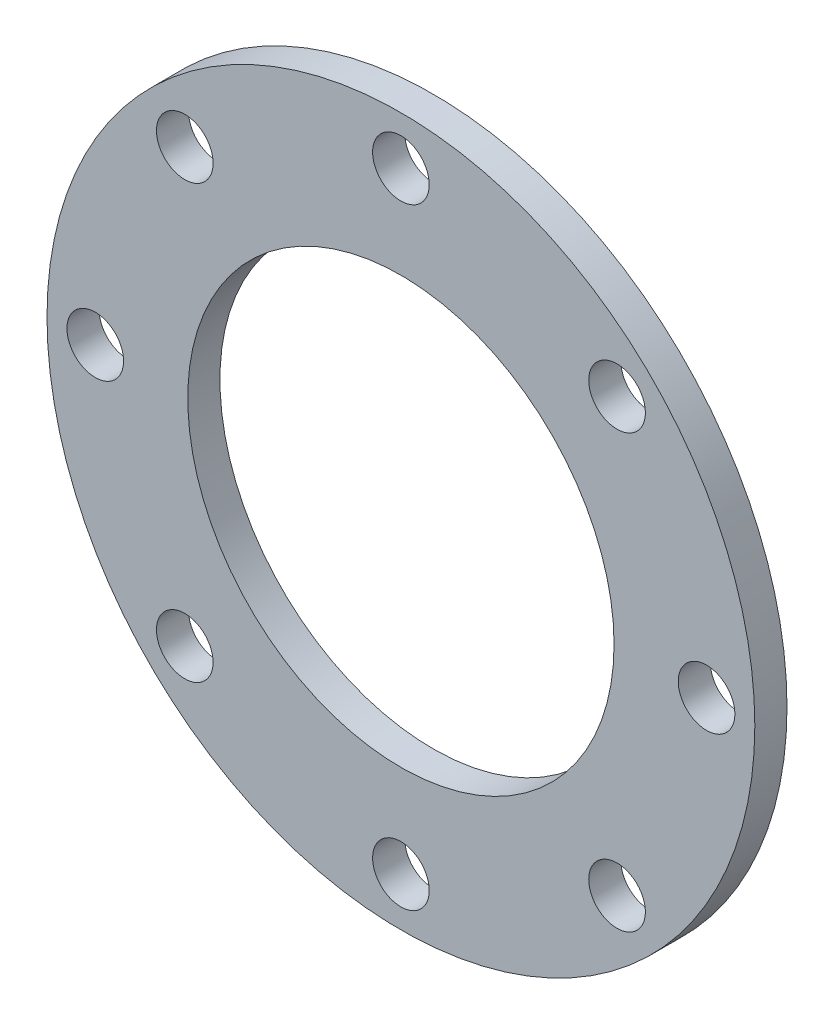
ISO-10303-21;
HEADER;
FILE_DESCRIPTION(('STEP AP214'),'2;1');
FILE_NAME('part.step','',(''),(''),'','','');
FILE_SCHEMA(('AUTOMOTIVE_DESIGN { 1 0 10303 214 1 1 1 1 }'));
ENDSEC;
DATA;
#1=APPLICATION_CONTEXT('core data for automotive mechanical design processes');
#2=APPLICATION_PROTOCOL_DEFINITION('international standard','automotive_design',2000,#1);
#3=PRODUCT_CONTEXT('',#1,'mechanical');
#4=PRODUCT('Part','Part','',(#3));
#5=PRODUCT_RELATED_PRODUCT_CATEGORY('part','',(#4));
#6=PRODUCT_DEFINITION_FORMATION('','',#4);
#7=PRODUCT_DEFINITION_CONTEXT('part definition',#1,'design');
#8=PRODUCT_DEFINITION('design','',#6,#7);
#9=PRODUCT_DEFINITION_SHAPE('','',#8);
#10=(LENGTH_UNIT() NAMED_UNIT(*) SI_UNIT(.MILLI.,.METRE.));
#11=(NAMED_UNIT(*) PLANE_ANGLE_UNIT() SI_UNIT($,.RADIAN.));
#12=(NAMED_UNIT(*) SI_UNIT($,.STERADIAN.) SOLID_ANGLE_UNIT());
#13=UNCERTAINTY_MEASURE_WITH_UNIT(LENGTH_MEASURE(1.E-05),#10,'distance_accuracy_value','');
#14=(GEOMETRIC_REPRESENTATION_CONTEXT(3) GLOBAL_UNCERTAINTY_ASSIGNED_CONTEXT((#13)) GLOBAL_UNIT_ASSIGNED_CONTEXT((#10,
#11,#12)) REPRESENTATION_CONTEXT('',''));
#15=CARTESIAN_POINT('',(0.,0.,0.));
#16=DIRECTION('',(0.,0.,1.));
#17=DIRECTION('',(1.,0.,0.));
#18=AXIS2_PLACEMENT_3D('',#15,#16,#17);
#19=CARTESIAN_POINT('',(0.,0.,12.7));
#20=DIRECTION('',(0.,0.,1.));
#21=DIRECTION('',(1.,0.,0.));
#22=AXIS2_PLACEMENT_3D('',#19,#20,#21);
#23=PLANE('',#22);
#24=CARTESIAN_POINT('',(-4.28186117435331E-13,120.65,12.7));
#25=DIRECTION('',(0.,0.,1.));
#26=DIRECTION('',(0.,1.,0.));
#27=AXIS2_PLACEMENT_3D('',#24,#25,#26);
#28=CIRCLE('',#27,11.176);
#29=CARTESIAN_POINT('',(-4.67206912878242E-13,131.826,12.7));
#30=VERTEX_POINT('',#29);
#31=EDGE_CURVE('E68',#30,#30,#28,.T.);
#32=ORIENTED_EDGE('',*,*,#31,.F.);
#33=EDGE_LOOP('',(#32));
#34=FACE_BOUND('',#33,.T.);
#35=CARTESIAN_POINT('',(-85.3124331501574,85.3124331501565,12.7));
#36=DIRECTION('',(0.,0.,1.));
#37=DIRECTION('',(-0.707106781186551,0.707106781186544,0.));
#38=AXIS2_PLACEMENT_3D('',#35,#36,#37);
#39=CIRCLE('',#38,11.176);
#40=CARTESIAN_POINT('',(-93.2150585366983,93.2150585366973,12.7));
#41=VERTEX_POINT('',#40);
#42=EDGE_CURVE('E83',#41,#41,#39,.T.);
#43=ORIENTED_EDGE('',*,*,#42,.F.);
#44=EDGE_LOOP('',(#43));
#45=FACE_BOUND('',#44,.T.);
#46=CARTESIAN_POINT('',(-120.65,0.,12.7));
#47=DIRECTION('',(0.,0.,1.));
#48=DIRECTION('',(-1.,0.,0.));
#49=AXIS2_PLACEMENT_3D('',#46,#47,#48);
#50=CIRCLE('',#49,11.176);
#51=CARTESIAN_POINT('',(-131.826,0.,12.7));
#52=VERTEX_POINT('',#51);
#53=EDGE_CURVE('E77',#52,#52,#50,.T.);
#54=ORIENTED_EDGE('',*,*,#53,.F.);
#55=EDGE_LOOP('',(#54));
#56=FACE_BOUND('',#55,.T.);
#57=CARTESIAN_POINT('',(-85.3124331501562,-85.3124331501577,12.7));
#58=DIRECTION('',(0.,0.,1.));
#59=DIRECTION('',(-0.707106781186541,-0.707106781186554,0.));
#60=AXIS2_PLACEMENT_3D('',#57,#58,#59);
#61=CIRCLE('',#60,11.176);
#62=CARTESIAN_POINT('',(-93.215058536697,-93.2150585366986,12.7));
#63=VERTEX_POINT('',#62);
#64=EDGE_CURVE('E69',#63,#63,#61,.T.);
#65=ORIENTED_EDGE('',*,*,#64,.F.);
#66=EDGE_LOOP('',(#65));
#67=FACE_BOUND('',#66,.T.);
#68=CARTESIAN_POINT('',(1.27068056449818E-12,-120.65,12.7));
#69=DIRECTION('',(0.,0.,1.));
#70=DIRECTION('',(0.,-1.,0.));
#71=AXIS2_PLACEMENT_3D('',#68,#69,#70);
#72=CIRCLE('',#71,11.176);
#73=CARTESIAN_POINT('',(1.38774295082691E-12,-131.826,12.7));
#74=VERTEX_POINT('',#73);
#75=EDGE_CURVE('E76',#74,#74,#72,.T.);
#76=ORIENTED_EDGE('',*,*,#75,.F.);
#77=EDGE_LOOP('',(#76));
#78=FACE_BOUND('',#77,.T.);
#79=CARTESIAN_POINT('',(85.312433150158,-85.3124331501559,12.7));
#80=DIRECTION('',(0.,0.,1.));
#81=DIRECTION('',(0.707106781186556,-0.707106781186539,0.));
#82=AXIS2_PLACEMENT_3D('',#79,#80,#81);
#83=CIRCLE('',#82,11.176);
#84=CARTESIAN_POINT('',(93.2150585366989,-93.2150585366967,12.7));
#85=VERTEX_POINT('',#84);
#86=EDGE_CURVE('E93',#85,#85,#83,.T.);
#87=ORIENTED_EDGE('',*,*,#86,.F.);
#88=EDGE_LOOP('',(#87));
#89=FACE_BOUND('',#88,.T.);
#90=CARTESIAN_POINT('',(85.3124331501568,85.3124331501571,12.7));
#91=DIRECTION('',(0.,0.,1.));
#92=DIRECTION('',(0.707106781186546,0.707106781186549,0.));
#93=AXIS2_PLACEMENT_3D('',#90,#91,#92);
#94=CIRCLE('',#93,11.176);
#95=CARTESIAN_POINT('',(93.2150585366977,93.215058536698,12.7));
#96=VERTEX_POINT('',#95);
#97=EDGE_CURVE('E62',#96,#96,#94,.T.);
#98=ORIENTED_EDGE('',*,*,#97,.F.);
#99=EDGE_LOOP('',(#98));
#100=FACE_BOUND('',#99,.T.);
#101=CARTESIAN_POINT('',(120.65,0.,12.7));
#102=DIRECTION('',(0.,0.,1.));
#103=DIRECTION('',(1.,0.,0.));
#104=AXIS2_PLACEMENT_3D('',#101,#102,#103);
#105=CIRCLE('',#104,11.176);
#106=CARTESIAN_POINT('',(131.826,0.,12.7));
#107=VERTEX_POINT('',#106);
#108=EDGE_CURVE('E59',#107,#107,#105,.T.);
#109=ORIENTED_EDGE('',*,*,#108,.F.);
#110=EDGE_LOOP('',(#109));
#111=FACE_BOUND('',#110,.T.);
#112=CARTESIAN_POINT('',(0.,0.,12.7));
#113=DIRECTION('',(0.,0.,1.));
#114=DIRECTION('',(1.,0.,0.));
#115=AXIS2_PLACEMENT_3D('',#112,#113,#114);
#116=CIRCLE('',#115,139.7);
#117=CARTESIAN_POINT('',(139.7,0.,12.7));
#118=VERTEX_POINT('',#117);
#119=EDGE_CURVE('E10',#118,#118,#116,.T.);
#120=ORIENTED_EDGE('',*,*,#119,.T.);
#121=EDGE_LOOP('',(#120));
#122=FACE_BOUND('',#121,.T.);
#123=CARTESIAN_POINT('',(0.,0.,12.7));
#124=DIRECTION('',(0.,0.,1.));
#125=DIRECTION('',(1.,0.,0.));
#126=AXIS2_PLACEMENT_3D('',#123,#124,#125);
#127=CIRCLE('',#126,84.1375);
#128=CARTESIAN_POINT('',(84.1375,0.,12.7));
#129=VERTEX_POINT('',#128);
#130=EDGE_CURVE('E49',#129,#129,#127,.T.);
#131=ORIENTED_EDGE('',*,*,#130,.F.);
#132=EDGE_LOOP('',(#131));
#133=FACE_BOUND('',#132,.T.);
#134=ADVANCED_FACE('F38',(#34,#45,#56,#67,#78,#89,#100,#111,#122,#133),#23,.T.);
#135=CARTESIAN_POINT('',(0.,0.,0.));
#136=DIRECTION('',(0.,0.,1.));
#137=DIRECTION('',(1.,0.,0.));
#138=AXIS2_PLACEMENT_3D('',#135,#136,#137);
#139=PLANE('',#138);
#140=CARTESIAN_POINT('',(-4.28186117435331E-13,120.65,0.));
#141=DIRECTION('',(0.,0.,1.));
#142=DIRECTION('',(0.,1.,0.));
#143=AXIS2_PLACEMENT_3D('',#140,#141,#142);
#144=CIRCLE('',#143,11.176);
#145=CARTESIAN_POINT('',(-4.67206912878242E-13,131.826,0.));
#146=VERTEX_POINT('',#145);
#147=EDGE_CURVE('E86',#146,#146,#144,.T.);
#148=ORIENTED_EDGE('',*,*,#147,.T.);
#149=EDGE_LOOP('',(#148));
#150=FACE_BOUND('',#149,.T.);
#151=CARTESIAN_POINT('',(-85.3124331501574,85.3124331501565,0.));
#152=DIRECTION('',(0.,0.,1.));
#153=DIRECTION('',(-0.707106781186551,0.707106781186544,0.));
#154=AXIS2_PLACEMENT_3D('',#151,#152,#153);
#155=CIRCLE('',#154,11.176);
#156=CARTESIAN_POINT('',(-93.2150585366983,93.2150585366973,0.));
#157=VERTEX_POINT('',#156);
#158=EDGE_CURVE('E80',#157,#157,#155,.T.);
#159=ORIENTED_EDGE('',*,*,#158,.T.);
#160=EDGE_LOOP('',(#159));
#161=FACE_BOUND('',#160,.T.);
#162=CARTESIAN_POINT('',(-120.65,0.,0.));
#163=DIRECTION('',(0.,0.,1.));
#164=DIRECTION('',(-1.,0.,0.));
#165=AXIS2_PLACEMENT_3D('',#162,#163,#164);
#166=CIRCLE('',#165,11.176);
#167=CARTESIAN_POINT('',(-131.826,0.,0.));
#168=VERTEX_POINT('',#167);
#169=EDGE_CURVE('E72',#168,#168,#166,.T.);
#170=ORIENTED_EDGE('',*,*,#169,.T.);
#171=EDGE_LOOP('',(#170));
#172=FACE_BOUND('',#171,.T.);
#173=CARTESIAN_POINT('',(-85.3124331501562,-85.3124331501577,0.));
#174=DIRECTION('',(0.,0.,1.));
#175=DIRECTION('',(-0.707106781186541,-0.707106781186554,0.));
#176=AXIS2_PLACEMENT_3D('',#173,#174,#175);
#177=CIRCLE('',#176,11.176);
#178=CARTESIAN_POINT('',(-93.215058536697,-93.2150585366986,0.));
#179=VERTEX_POINT('',#178);
#180=EDGE_CURVE('E73',#179,#179,#177,.T.);
#181=ORIENTED_EDGE('',*,*,#180,.T.);
#182=EDGE_LOOP('',(#181));
#183=FACE_BOUND('',#182,.T.);
#184=CARTESIAN_POINT('',(1.27068056449818E-12,-120.65,0.));
#185=DIRECTION('',(0.,0.,1.));
#186=DIRECTION('',(0.,-1.,0.));
#187=AXIS2_PLACEMENT_3D('',#184,#185,#186);
#188=CIRCLE('',#187,11.176);
#189=CARTESIAN_POINT('',(1.38774295082691E-12,-131.826,0.));
#190=VERTEX_POINT('',#189);
#191=EDGE_CURVE('E96',#190,#190,#188,.T.);
#192=ORIENTED_EDGE('',*,*,#191,.T.);
#193=EDGE_LOOP('',(#192));
#194=FACE_BOUND('',#193,.T.);
#195=CARTESIAN_POINT('',(85.312433150158,-85.3124331501559,0.));
#196=DIRECTION('',(0.,0.,1.));
#197=DIRECTION('',(0.707106781186556,-0.707106781186539,0.));
#198=AXIS2_PLACEMENT_3D('',#195,#196,#197);
#199=CIRCLE('',#198,11.176);
#200=CARTESIAN_POINT('',(93.2150585366989,-93.2150585366967,0.));
#201=VERTEX_POINT('',#200);
#202=EDGE_CURVE('E97',#201,#201,#199,.T.);
#203=ORIENTED_EDGE('',*,*,#202,.T.);
#204=EDGE_LOOP('',(#203));
#205=FACE_BOUND('',#204,.T.);
#206=CARTESIAN_POINT('',(85.3124331501568,85.3124331501571,0.));
#207=DIRECTION('',(0.,0.,1.));
#208=DIRECTION('',(0.707106781186546,0.707106781186549,0.));
#209=AXIS2_PLACEMENT_3D('',#206,#207,#208);
#210=CIRCLE('',#209,11.176);
#211=CARTESIAN_POINT('',(93.2150585366977,93.215058536698,0.));
#212=VERTEX_POINT('',#211);
#213=EDGE_CURVE('E65',#212,#212,#210,.T.);
#214=ORIENTED_EDGE('',*,*,#213,.T.);
#215=EDGE_LOOP('',(#214));
#216=FACE_BOUND('',#215,.T.);
#217=CARTESIAN_POINT('',(120.65,0.,0.));
#218=DIRECTION('',(0.,0.,1.));
#219=DIRECTION('',(1.,0.,0.));
#220=AXIS2_PLACEMENT_3D('',#217,#218,#219);
#221=CIRCLE('',#220,11.176);
#222=CARTESIAN_POINT('',(131.826,0.,0.));
#223=VERTEX_POINT('',#222);
#224=EDGE_CURVE('E54',#223,#223,#221,.T.);
#225=ORIENTED_EDGE('',*,*,#224,.T.);
#226=EDGE_LOOP('',(#225));
#227=FACE_BOUND('',#226,.T.);
#228=CARTESIAN_POINT('',(0.,0.,0.));
#229=DIRECTION('',(0.,0.,1.));
#230=DIRECTION('',(1.,0.,0.));
#231=AXIS2_PLACEMENT_3D('',#228,#229,#230);
#232=CIRCLE('',#231,139.7);
#233=CARTESIAN_POINT('',(139.7,0.,0.));
#234=VERTEX_POINT('',#233);
#235=EDGE_CURVE('E42',#234,#234,#232,.T.);
#236=ORIENTED_EDGE('',*,*,#235,.F.);
#237=EDGE_LOOP('',(#236));
#238=FACE_BOUND('',#237,.T.);
#239=CARTESIAN_POINT('',(0.,0.,0.));
#240=DIRECTION('',(0.,0.,1.));
#241=DIRECTION('',(1.,0.,0.));
#242=AXIS2_PLACEMENT_3D('',#239,#240,#241);
#243=CIRCLE('',#242,84.1375);
#244=CARTESIAN_POINT('',(84.1375,0.,0.));
#245=VERTEX_POINT('',#244);
#246=EDGE_CURVE('E51',#245,#245,#243,.T.);
#247=ORIENTED_EDGE('',*,*,#246,.T.);
#248=EDGE_LOOP('',(#247));
#249=FACE_BOUND('',#248,.T.);
#250=ADVANCED_FACE('F105',(#150,#161,#172,#183,#194,#205,#216,#227,#238,#249),#139,.F.);
#251=CARTESIAN_POINT('',(0.,0.,12.7));
#252=DIRECTION('',(0.,0.,-1.));
#253=DIRECTION('',(-1.,0.,0.));
#254=AXIS2_PLACEMENT_3D('',#251,#252,#253);
#255=CYLINDRICAL_SURFACE('',#254,139.7);
#256=ORIENTED_EDGE('',*,*,#119,.F.);
#257=EDGE_LOOP('',(#256));
#258=FACE_BOUND('',#257,.T.);
#259=ORIENTED_EDGE('',*,*,#235,.T.);
#260=EDGE_LOOP('',(#259));
#261=FACE_BOUND('',#260,.T.);
#262=ADVANCED_FACE('F40',(#258,#261),#255,.T.);
#263=CARTESIAN_POINT('',(0.,0.,12.7));
#264=DIRECTION('',(0.,0.,-1.));
#265=DIRECTION('',(-1.,0.,0.));
#266=AXIS2_PLACEMENT_3D('',#263,#264,#265);
#267=CYLINDRICAL_SURFACE('',#266,84.1375);
#268=ORIENTED_EDGE('',*,*,#130,.T.);
#269=EDGE_LOOP('',(#268));
#270=FACE_BOUND('',#269,.T.);
#271=ORIENTED_EDGE('',*,*,#246,.F.);
#272=EDGE_LOOP('',(#271));
#273=FACE_BOUND('',#272,.T.);
#274=ADVANCED_FACE('F128',(#270,#273),#267,.F.);
#275=CARTESIAN_POINT('',(120.65,0.,12.7));
#276=DIRECTION('',(0.,0.,1.));
#277=DIRECTION('',(1.,0.,0.));
#278=AXIS2_PLACEMENT_3D('',#275,#276,#277);
#279=CYLINDRICAL_SURFACE('',#278,11.176);
#280=ORIENTED_EDGE('',*,*,#224,.F.);
#281=EDGE_LOOP('',(#280));
#282=FACE_BOUND('',#281,.T.);
#283=ORIENTED_EDGE('',*,*,#108,.T.);
#284=EDGE_LOOP('',(#283));
#285=FACE_BOUND('',#284,.T.);
#286=ADVANCED_FACE('F131',(#282,#285),#279,.F.);
#287=CARTESIAN_POINT('',(85.3124331501568,85.3124331501571,12.7));
#288=DIRECTION('',(0.,0.,1.));
#289=DIRECTION('',(0.707106781186546,0.707106781186549,0.));
#290=AXIS2_PLACEMENT_3D('',#287,#288,#289);
#291=CYLINDRICAL_SURFACE('',#290,11.176);
#292=ORIENTED_EDGE('',*,*,#213,.F.);
#293=EDGE_LOOP('',(#292));
#294=FACE_BOUND('',#293,.T.);
#295=ORIENTED_EDGE('',*,*,#97,.T.);
#296=EDGE_LOOP('',(#295));
#297=FACE_BOUND('',#296,.T.);
#298=ADVANCED_FACE('F145',(#294,#297),#291,.F.);
#299=CARTESIAN_POINT('',(85.312433150158,-85.3124331501559,12.7));
#300=DIRECTION('',(0.,0.,1.));
#301=DIRECTION('',(0.707106781186556,-0.707106781186539,0.));
#302=AXIS2_PLACEMENT_3D('',#299,#300,#301);
#303=CYLINDRICAL_SURFACE('',#302,11.176);
#304=ORIENTED_EDGE('',*,*,#202,.F.);
#305=EDGE_LOOP('',(#304));
#306=FACE_BOUND('',#305,.T.);
#307=ORIENTED_EDGE('',*,*,#86,.T.);
#308=EDGE_LOOP('',(#307));
#309=FACE_BOUND('',#308,.T.);
#310=ADVANCED_FACE('F112',(#306,#309),#303,.F.);
#311=CARTESIAN_POINT('',(1.27068056449818E-12,-120.65,12.7));
#312=DIRECTION('',(0.,0.,1.));
#313=DIRECTION('',(0.,-1.,0.));
#314=AXIS2_PLACEMENT_3D('',#311,#312,#313);
#315=CYLINDRICAL_SURFACE('',#314,11.176);
#316=ORIENTED_EDGE('',*,*,#191,.F.);
#317=EDGE_LOOP('',(#316));
#318=FACE_BOUND('',#317,.T.);
#319=ORIENTED_EDGE('',*,*,#75,.T.);
#320=EDGE_LOOP('',(#319));
#321=FACE_BOUND('',#320,.T.);
#322=ADVANCED_FACE('F108',(#318,#321),#315,.F.);
#323=CARTESIAN_POINT('',(-85.3124331501562,-85.3124331501577,12.7));
#324=DIRECTION('',(0.,0.,1.));
#325=DIRECTION('',(-0.707106781186541,-0.707106781186554,0.));
#326=AXIS2_PLACEMENT_3D('',#323,#324,#325);
#327=CYLINDRICAL_SURFACE('',#326,11.176);
#328=ORIENTED_EDGE('',*,*,#180,.F.);
#329=EDGE_LOOP('',(#328));
#330=FACE_BOUND('',#329,.T.);
#331=ORIENTED_EDGE('',*,*,#64,.T.);
#332=EDGE_LOOP('',(#331));
#333=FACE_BOUND('',#332,.T.);
#334=ADVANCED_FACE('F111',(#330,#333),#327,.F.);
#335=CARTESIAN_POINT('',(-120.65,0.,12.7));
#336=DIRECTION('',(0.,0.,1.));
#337=DIRECTION('',(-1.,0.,0.));
#338=AXIS2_PLACEMENT_3D('',#335,#336,#337);
#339=CYLINDRICAL_SURFACE('',#338,11.176);
#340=ORIENTED_EDGE('',*,*,#169,.F.);
#341=EDGE_LOOP('',(#340));
#342=FACE_BOUND('',#341,.T.);
#343=ORIENTED_EDGE('',*,*,#53,.T.);
#344=EDGE_LOOP('',(#343));
#345=FACE_BOUND('',#344,.T.);
#346=ADVANCED_FACE('F152',(#342,#345),#339,.F.);
#347=CARTESIAN_POINT('',(-85.3124331501574,85.3124331501565,12.7));
#348=DIRECTION('',(0.,0.,1.));
#349=DIRECTION('',(-0.707106781186551,0.707106781186544,0.));
#350=AXIS2_PLACEMENT_3D('',#347,#348,#349);
#351=CYLINDRICAL_SURFACE('',#350,11.176);
#352=ORIENTED_EDGE('',*,*,#158,.F.);
#353=EDGE_LOOP('',(#352));
#354=FACE_BOUND('',#353,.T.);
#355=ORIENTED_EDGE('',*,*,#42,.T.);
#356=EDGE_LOOP('',(#355));
#357=FACE_BOUND('',#356,.T.);
#358=ADVANCED_FACE('F156',(#354,#357),#351,.F.);
#359=CARTESIAN_POINT('',(-4.28186117435331E-13,120.65,12.7));
#360=DIRECTION('',(0.,0.,1.));
#361=DIRECTION('',(0.,1.,0.));
#362=AXIS2_PLACEMENT_3D('',#359,#360,#361);
#363=CYLINDRICAL_SURFACE('',#362,11.176);
#364=ORIENTED_EDGE('',*,*,#147,.F.);
#365=EDGE_LOOP('',(#364));
#366=FACE_BOUND('',#365,.T.);
#367=ORIENTED_EDGE('',*,*,#31,.T.);
#368=EDGE_LOOP('',(#367));
#369=FACE_BOUND('',#368,.T.);
#370=ADVANCED_FACE('F160',(#366,#369),#363,.F.);
#371=CLOSED_SHELL('',(#134,#250,#262,#274,#286,#298,#310,#322,#334,#346,#358,#370));
#372=MANIFOLD_SOLID_BREP('B2',#371);
#373=ADVANCED_BREP_SHAPE_REPRESENTATION('',(#18,#372),#14);
#374=SHAPE_DEFINITION_REPRESENTATION(#9,#373);
ENDSEC;
END-ISO-10303-21;
